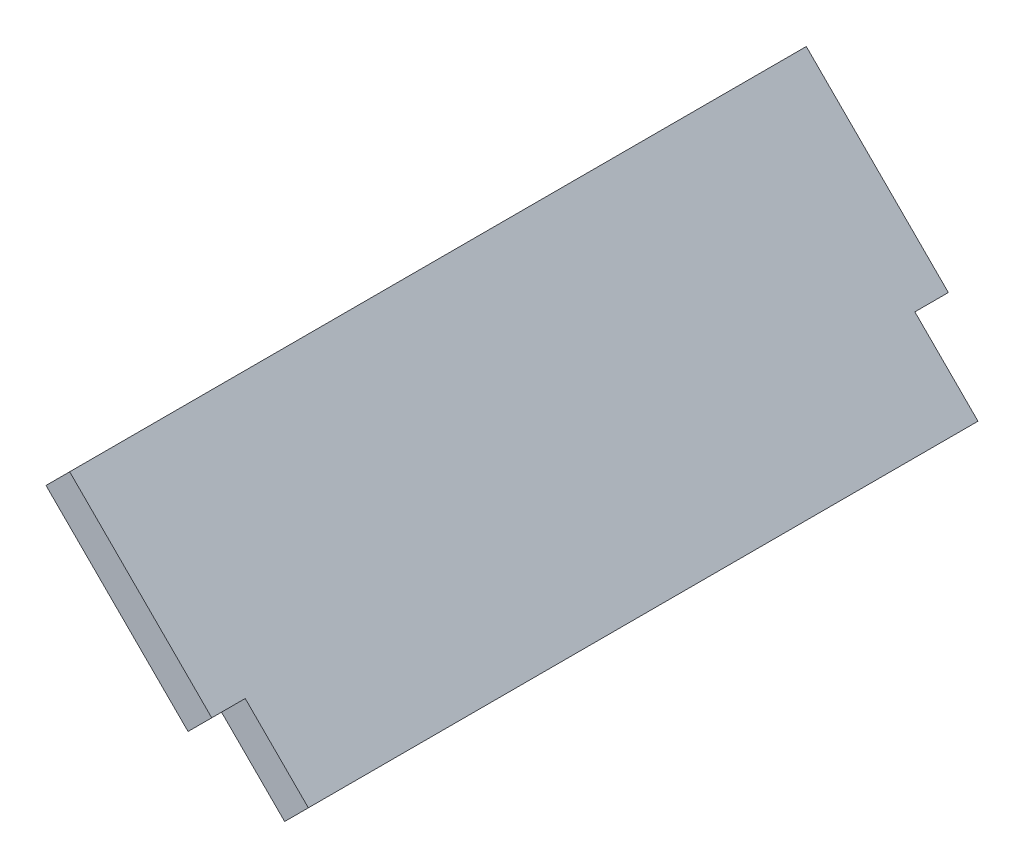
ISO-10303-21;
HEADER;
FILE_DESCRIPTION(('STEP AP214'),'2;1');
FILE_NAME('part.step','',(''),(''),'','','');
FILE_SCHEMA(('AUTOMOTIVE_DESIGN { 1 0 10303 214 1 1 1 1 }'));
ENDSEC;
DATA;
#1=APPLICATION_CONTEXT('core data for automotive mechanical design processes');
#2=APPLICATION_PROTOCOL_DEFINITION('international standard','automotive_design',2000,#1);
#3=PRODUCT_CONTEXT('',#1,'mechanical');
#4=PRODUCT('Part','Part','',(#3));
#5=PRODUCT_RELATED_PRODUCT_CATEGORY('part','',(#4));
#6=PRODUCT_DEFINITION_FORMATION('','',#4);
#7=PRODUCT_DEFINITION_CONTEXT('part definition',#1,'design');
#8=PRODUCT_DEFINITION('design','',#6,#7);
#9=PRODUCT_DEFINITION_SHAPE('','',#8);
#10=(LENGTH_UNIT() NAMED_UNIT(*) SI_UNIT(.MILLI.,.METRE.));
#11=(NAMED_UNIT(*) PLANE_ANGLE_UNIT() SI_UNIT($,.RADIAN.));
#12=(NAMED_UNIT(*) SI_UNIT($,.STERADIAN.) SOLID_ANGLE_UNIT());
#13=UNCERTAINTY_MEASURE_WITH_UNIT(LENGTH_MEASURE(1.E-05),#10,'distance_accuracy_value','');
#14=(GEOMETRIC_REPRESENTATION_CONTEXT(3) GLOBAL_UNCERTAINTY_ASSIGNED_CONTEXT((#13)) GLOBAL_UNIT_ASSIGNED_CONTEXT((#10,
#11,#12)) REPRESENTATION_CONTEXT('',''));
#15=CARTESIAN_POINT('',(0.,0.,0.));
#16=DIRECTION('',(0.,0.,1.));
#17=DIRECTION('',(1.,0.,0.));
#18=AXIS2_PLACEMENT_3D('',#15,#16,#17);
#19=CARTESIAN_POINT('',(-57.8786796564404,62.1213203435596,0.));
#20=DIRECTION('',(0.,0.,-1.));
#21=DIRECTION('',(-1.,0.,0.));
#22=AXIS2_PLACEMENT_3D('',#19,#20,#21);
#23=PLANE('',#22);
#24=DIRECTION('',(0.707106781186548,-0.707106781186547,0.));
#25=VECTOR('',#24,1.);
#26=CARTESIAN_POINT('',(-60.,60.,0.));
#27=LINE('',#26,#25);
#28=CARTESIAN_POINT('',(-60.,60.,0.));
#29=VERTEX_POINT('',#28);
#30=CARTESIAN_POINT('',(-47.2720779386422,47.2720779386421,0.));
#31=VERTEX_POINT('',#30);
#32=EDGE_CURVE('E129',#29,#31,#27,.T.);
#33=ORIENTED_EDGE('',*,*,#32,.T.);
#34=DIRECTION('',(-0.707106781186547,-0.707106781186548,0.));
#35=VECTOR('',#34,1.);
#36=CARTESIAN_POINT('',(-45.1507575950825,49.3933982822018,0.));
#37=LINE('',#36,#35);
#38=CARTESIAN_POINT('',(-45.1507575950825,49.3933982822018,0.));
#39=VERTEX_POINT('',#38);
#40=EDGE_CURVE('E41',#39,#31,#37,.T.);
#41=ORIENTED_EDGE('',*,*,#40,.F.);
#42=DIRECTION('',(0.707106781186548,-0.707106781186547,0.));
#43=VECTOR('',#42,1.);
#44=CARTESIAN_POINT('',(-57.8786796564404,62.1213203435596,0.));
#45=LINE('',#44,#43);
#46=CARTESIAN_POINT('',(-57.8786796564404,62.1213203435596,0.));
#47=VERTEX_POINT('',#46);
#48=EDGE_CURVE('E176',#47,#39,#45,.T.);
#49=ORIENTED_EDGE('',*,*,#48,.F.);
#50=DIRECTION('',(-0.707106781186547,-0.707106781186548,0.));
#51=VECTOR('',#50,1.);
#52=CARTESIAN_POINT('',(-57.8786796564404,62.1213203435596,0.));
#53=LINE('',#52,#51);
#54=EDGE_CURVE('E11',#47,#29,#53,.T.);
#55=ORIENTED_EDGE('',*,*,#54,.T.);
#56=EDGE_LOOP('',(#33,#41,#49,#55));
#57=FACE_BOUND('',#56,.T.);
#58=ADVANCED_FACE('F33',(#57),#23,.F.);
#59=CARTESIAN_POINT('',(-45.1507575950825,49.3933982822018,0.));
#60=DIRECTION('',(-0.707106781186548,0.707106781186547,0.));
#61=DIRECTION('',(-0.707106781186547,-0.707106781186548,0.));
#62=AXIS2_PLACEMENT_3D('',#59,#60,#61);
#63=PLANE('',#62);
#64=DIRECTION('',(0.,0.,-1.));
#65=VECTOR('',#64,1.);
#66=CARTESIAN_POINT('',(-47.2720779386422,47.2720779386421,0.));
#67=LINE('',#66,#65);
#68=CARTESIAN_POINT('',(-47.2720779386422,47.2720779386421,-3.00000000000002));
#69=VERTEX_POINT('',#68);
#70=EDGE_CURVE('E131',#31,#69,#67,.T.);
#71=ORIENTED_EDGE('',*,*,#70,.T.);
#72=DIRECTION('',(-0.707106781186547,-0.707106781186548,0.));
#73=VECTOR('',#72,1.);
#74=CARTESIAN_POINT('',(-45.1507575950825,49.3933982822018,-3.00000000000002));
#75=LINE('',#74,#73);
#76=CARTESIAN_POINT('',(-45.1507575950825,49.3933982822018,-3.00000000000002));
#77=VERTEX_POINT('',#76);
#78=EDGE_CURVE('E148',#77,#69,#75,.T.);
#79=ORIENTED_EDGE('',*,*,#78,.F.);
#80=DIRECTION('',(0.,0.,-1.));
#81=VECTOR('',#80,1.);
#82=CARTESIAN_POINT('',(-45.1507575950825,49.3933982822018,0.));
#83=LINE('',#82,#81);
#84=EDGE_CURVE('E157',#39,#77,#83,.T.);
#85=ORIENTED_EDGE('',*,*,#84,.F.);
#86=ORIENTED_EDGE('',*,*,#40,.T.);
#87=EDGE_LOOP('',(#71,#79,#85,#86));
#88=FACE_BOUND('',#87,.T.);
#89=ADVANCED_FACE('F155',(#88),#63,.F.);
#90=CARTESIAN_POINT('',(-45.1507575950825,49.3933982822018,-3.00000000000002));
#91=DIRECTION('',(0.,0.,-1.));
#92=DIRECTION('',(-1.,0.,0.));
#93=AXIS2_PLACEMENT_3D('',#90,#91,#92);
#94=PLANE('',#93);
#95=DIRECTION('',(0.707106781186548,-0.707106781186547,0.));
#96=VECTOR('',#95,1.);
#97=CARTESIAN_POINT('',(-47.2720779386422,47.2720779386421,-3.00000000000002));
#98=LINE('',#97,#96);
#99=CARTESIAN_POINT('',(-41.6152236891498,41.6152236891497,-3.00000000000002));
#100=VERTEX_POINT('',#99);
#101=EDGE_CURVE('E133',#69,#100,#98,.T.);
#102=ORIENTED_EDGE('',*,*,#101,.T.);
#103=DIRECTION('',(-0.707106781186547,-0.707106781186548,0.));
#104=VECTOR('',#103,1.);
#105=CARTESIAN_POINT('',(-39.4939033455901,43.7365440327094,-3.00000000000002));
#106=LINE('',#105,#104);
#107=CARTESIAN_POINT('',(-39.4939033455901,43.7365440327094,-3.00000000000002));
#108=VERTEX_POINT('',#107);
#109=EDGE_CURVE('E145',#108,#100,#106,.T.);
#110=ORIENTED_EDGE('',*,*,#109,.F.);
#111=DIRECTION('',(0.707106781186548,-0.707106781186547,0.));
#112=VECTOR('',#111,1.);
#113=CARTESIAN_POINT('',(-45.1507575950825,49.3933982822018,-3.00000000000002));
#114=LINE('',#113,#112);
#115=EDGE_CURVE('E172',#77,#108,#114,.T.);
#116=ORIENTED_EDGE('',*,*,#115,.F.);
#117=ORIENTED_EDGE('',*,*,#78,.T.);
#118=EDGE_LOOP('',(#102,#110,#116,#117));
#119=FACE_BOUND('',#118,.T.);
#120=ADVANCED_FACE('F168',(#119),#94,.F.);
#121=CARTESIAN_POINT('',(-39.4939033455901,43.7365440327094,-63.));
#122=DIRECTION('',(-0.707106781186548,0.707106781186547,0.));
#123=DIRECTION('',(-0.707106781186547,-0.707106781186548,0.));
#124=AXIS2_PLACEMENT_3D('',#121,#122,#123);
#125=PLANE('',#124);
#126=DIRECTION('',(0.,0.,-1.));
#127=VECTOR('',#126,1.);
#128=CARTESIAN_POINT('',(-41.6152236891498,41.6152236891498,-63.));
#129=LINE('',#128,#127);
#130=CARTESIAN_POINT('',(-41.6152236891498,41.6152236891498,-63.));
#131=VERTEX_POINT('',#130);
#132=EDGE_CURVE('E135',#100,#131,#129,.T.);
#133=ORIENTED_EDGE('',*,*,#132,.T.);
#134=DIRECTION('',(-0.707106781186547,-0.707106781186548,0.));
#135=VECTOR('',#134,1.);
#136=CARTESIAN_POINT('',(-39.4939033455901,43.7365440327094,-63.));
#137=LINE('',#136,#135);
#138=CARTESIAN_POINT('',(-39.4939033455901,43.7365440327094,-63.));
#139=VERTEX_POINT('',#138);
#140=EDGE_CURVE('E118',#139,#131,#137,.T.);
#141=ORIENTED_EDGE('',*,*,#140,.F.);
#142=DIRECTION('',(0.,0.,-1.));
#143=VECTOR('',#142,1.);
#144=CARTESIAN_POINT('',(-39.4939033455901,43.7365440327094,-63.));
#145=LINE('',#144,#143);
#146=EDGE_CURVE('E109',#108,#139,#145,.T.);
#147=ORIENTED_EDGE('',*,*,#146,.F.);
#148=ORIENTED_EDGE('',*,*,#109,.T.);
#149=EDGE_LOOP('',(#133,#141,#147,#148));
#150=FACE_BOUND('',#149,.T.);
#151=ADVANCED_FACE('F171',(#150),#125,.F.);
#152=CARTESIAN_POINT('',(-45.1507575950825,49.3933982822018,-63.));
#153=DIRECTION('',(0.,0.,1.));
#154=DIRECTION('',(1.,0.,0.));
#155=AXIS2_PLACEMENT_3D('',#152,#153,#154);
#156=PLANE('',#155);
#157=DIRECTION('',(-0.707106781186548,0.707106781186547,0.));
#158=VECTOR('',#157,1.);
#159=CARTESIAN_POINT('',(-47.2720779386422,47.2720779386421,-63.));
#160=LINE('',#159,#158);
#161=CARTESIAN_POINT('',(-47.2720779386422,47.2720779386421,-63.));
#162=VERTEX_POINT('',#161);
#163=EDGE_CURVE('E117',#131,#162,#160,.T.);
#164=ORIENTED_EDGE('',*,*,#163,.T.);
#165=DIRECTION('',(-0.707106781186547,-0.707106781186548,0.));
#166=VECTOR('',#165,1.);
#167=CARTESIAN_POINT('',(-45.1507575950825,49.3933982822018,-63.));
#168=LINE('',#167,#166);
#169=CARTESIAN_POINT('',(-45.1507575950825,49.3933982822018,-63.));
#170=VERTEX_POINT('',#169);
#171=EDGE_CURVE('E114',#170,#162,#168,.T.);
#172=ORIENTED_EDGE('',*,*,#171,.F.);
#173=DIRECTION('',(-0.707106781186548,0.707106781186547,0.));
#174=VECTOR('',#173,1.);
#175=CARTESIAN_POINT('',(-45.1507575950825,49.3933982822018,-63.));
#176=LINE('',#175,#174);
#177=EDGE_CURVE('E103',#139,#170,#176,.T.);
#178=ORIENTED_EDGE('',*,*,#177,.F.);
#179=ORIENTED_EDGE('',*,*,#140,.T.);
#180=EDGE_LOOP('',(#164,#172,#178,#179));
#181=FACE_BOUND('',#180,.T.);
#182=ADVANCED_FACE('F115',(#181),#156,.F.);
#183=CARTESIAN_POINT('',(-45.1507575950825,49.3933982822018,-66.));
#184=DIRECTION('',(-0.707106781186548,0.707106781186547,0.));
#185=DIRECTION('',(-0.707106781186547,-0.707106781186548,0.));
#186=AXIS2_PLACEMENT_3D('',#183,#184,#185);
#187=PLANE('',#186);
#188=DIRECTION('',(0.,0.,-1.));
#189=VECTOR('',#188,1.);
#190=CARTESIAN_POINT('',(-47.2720779386422,47.2720779386421,-66.));
#191=LINE('',#190,#189);
#192=CARTESIAN_POINT('',(-47.2720779386422,47.2720779386421,-66.));
#193=VERTEX_POINT('',#192);
#194=EDGE_CURVE('E79',#162,#193,#191,.T.);
#195=ORIENTED_EDGE('',*,*,#194,.T.);
#196=DIRECTION('',(-0.707106781186547,-0.707106781186548,0.));
#197=VECTOR('',#196,1.);
#198=CARTESIAN_POINT('',(-45.1507575950825,49.3933982822018,-66.));
#199=LINE('',#198,#197);
#200=CARTESIAN_POINT('',(-45.1507575950825,49.3933982822018,-66.));
#201=VERTEX_POINT('',#200);
#202=EDGE_CURVE('E119',#201,#193,#199,.T.);
#203=ORIENTED_EDGE('',*,*,#202,.F.);
#204=DIRECTION('',(0.,0.,-1.));
#205=VECTOR('',#204,1.);
#206=CARTESIAN_POINT('',(-45.1507575950825,49.3933982822018,-66.));
#207=LINE('',#206,#205);
#208=EDGE_CURVE('E107',#170,#201,#207,.T.);
#209=ORIENTED_EDGE('',*,*,#208,.F.);
#210=ORIENTED_EDGE('',*,*,#171,.T.);
#211=EDGE_LOOP('',(#195,#203,#209,#210));
#212=FACE_BOUND('',#211,.T.);
#213=ADVANCED_FACE('F121',(#212),#187,.F.);
#214=CARTESIAN_POINT('',(-57.8786796564404,62.1213203435596,-66.));
#215=DIRECTION('',(0.,0.,1.));
#216=DIRECTION('',(1.,0.,0.));
#217=AXIS2_PLACEMENT_3D('',#214,#215,#216);
#218=PLANE('',#217);
#219=DIRECTION('',(-0.707106781186548,0.707106781186547,0.));
#220=VECTOR('',#219,1.);
#221=CARTESIAN_POINT('',(-60.,60.,-66.));
#222=LINE('',#221,#220);
#223=CARTESIAN_POINT('',(-60.,60.,-66.));
#224=VERTEX_POINT('',#223);
#225=EDGE_CURVE('E86',#193,#224,#222,.T.);
#226=ORIENTED_EDGE('',*,*,#225,.T.);
#227=DIRECTION('',(-0.707106781186547,-0.707106781186548,0.));
#228=VECTOR('',#227,1.);
#229=CARTESIAN_POINT('',(-57.8786796564404,62.1213203435596,-66.));
#230=LINE('',#229,#228);
#231=CARTESIAN_POINT('',(-57.8786796564404,62.1213203435596,-66.));
#232=VERTEX_POINT('',#231);
#233=EDGE_CURVE('E125',#232,#224,#230,.T.);
#234=ORIENTED_EDGE('',*,*,#233,.F.);
#235=DIRECTION('',(-0.707106781186548,0.707106781186547,0.));
#236=VECTOR('',#235,1.);
#237=CARTESIAN_POINT('',(-57.8786796564404,62.1213203435596,-66.));
#238=LINE('',#237,#236);
#239=EDGE_CURVE('E123',#201,#232,#238,.T.);
#240=ORIENTED_EDGE('',*,*,#239,.F.);
#241=ORIENTED_EDGE('',*,*,#202,.T.);
#242=EDGE_LOOP('',(#226,#234,#240,#241));
#243=FACE_BOUND('',#242,.T.);
#244=ADVANCED_FACE('F179',(#243),#218,.F.);
#245=CARTESIAN_POINT('',(-57.8786796564404,62.1213203435596,-63.));
#246=DIRECTION('',(0.707106781186548,-0.707106781186547,0.));
#247=DIRECTION('',(0.707106781186547,0.707106781186548,0.));
#248=AXIS2_PLACEMENT_3D('',#245,#246,#247);
#249=PLANE('',#248);
#250=DIRECTION('',(0.,0.,1.));
#251=VECTOR('',#250,1.);
#252=CARTESIAN_POINT('',(-60.,60.,-63.));
#253=LINE('',#252,#251);
#254=EDGE_CURVE('E140',#224,#29,#253,.T.);
#255=ORIENTED_EDGE('',*,*,#254,.T.);
#256=ORIENTED_EDGE('',*,*,#54,.F.);
#257=DIRECTION('',(0.,0.,1.));
#258=VECTOR('',#257,1.);
#259=CARTESIAN_POINT('',(-57.8786796564404,62.1213203435596,-63.));
#260=LINE('',#259,#258);
#261=EDGE_CURVE('E49',#232,#47,#260,.T.);
#262=ORIENTED_EDGE('',*,*,#261,.F.);
#263=ORIENTED_EDGE('',*,*,#233,.T.);
#264=EDGE_LOOP('',(#255,#256,#262,#263));
#265=FACE_BOUND('',#264,.T.);
#266=ADVANCED_FACE('F178',(#265),#249,.F.);
#267=CARTESIAN_POINT('',(2.12132034355963,2.12132034355963,0.));
#268=DIRECTION('',(0.707106781186547,0.707106781186548,0.));
#269=DIRECTION('',(-0.707106781186548,0.707106781186547,0.));
#270=AXIS2_PLACEMENT_3D('',#267,#268,#269);
#271=PLANE('',#270);
#272=ORIENTED_EDGE('',*,*,#261,.T.);
#273=ORIENTED_EDGE('',*,*,#48,.T.);
#274=ORIENTED_EDGE('',*,*,#84,.T.);
#275=ORIENTED_EDGE('',*,*,#115,.T.);
#276=ORIENTED_EDGE('',*,*,#146,.T.);
#277=ORIENTED_EDGE('',*,*,#177,.T.);
#278=ORIENTED_EDGE('',*,*,#208,.T.);
#279=ORIENTED_EDGE('',*,*,#239,.T.);
#280=EDGE_LOOP('',(#272,#273,#274,#275,#276,#277,#278,#279));
#281=FACE_BOUND('',#280,.T.);
#282=ADVANCED_FACE('F105',(#281),#271,.T.);
#283=CARTESIAN_POINT('',(0.,0.,0.));
#284=DIRECTION('',(0.707106781186547,0.707106781186548,0.));
#285=DIRECTION('',(-0.707106781186548,0.707106781186547,0.));
#286=AXIS2_PLACEMENT_3D('',#283,#284,#285);
#287=PLANE('',#286);
#288=ORIENTED_EDGE('',*,*,#32,.F.);
#289=ORIENTED_EDGE('',*,*,#254,.F.);
#290=ORIENTED_EDGE('',*,*,#225,.F.);
#291=ORIENTED_EDGE('',*,*,#194,.F.);
#292=ORIENTED_EDGE('',*,*,#163,.F.);
#293=ORIENTED_EDGE('',*,*,#132,.F.);
#294=ORIENTED_EDGE('',*,*,#101,.F.);
#295=ORIENTED_EDGE('',*,*,#70,.F.);
#296=EDGE_LOOP('',(#288,#289,#290,#291,#292,#293,#294,#295));
#297=FACE_BOUND('',#296,.T.);
#298=ADVANCED_FACE('F163',(#297),#287,.F.);
#299=CLOSED_SHELL('',(#58,#89,#120,#151,#182,#213,#244,#266,#282,#298));
#300=MANIFOLD_SOLID_BREP('B2',#299);
#301=ADVANCED_BREP_SHAPE_REPRESENTATION('',(#18,#300),#14);
#302=SHAPE_DEFINITION_REPRESENTATION(#9,#301);
ENDSEC;
END-ISO-10303-21;
